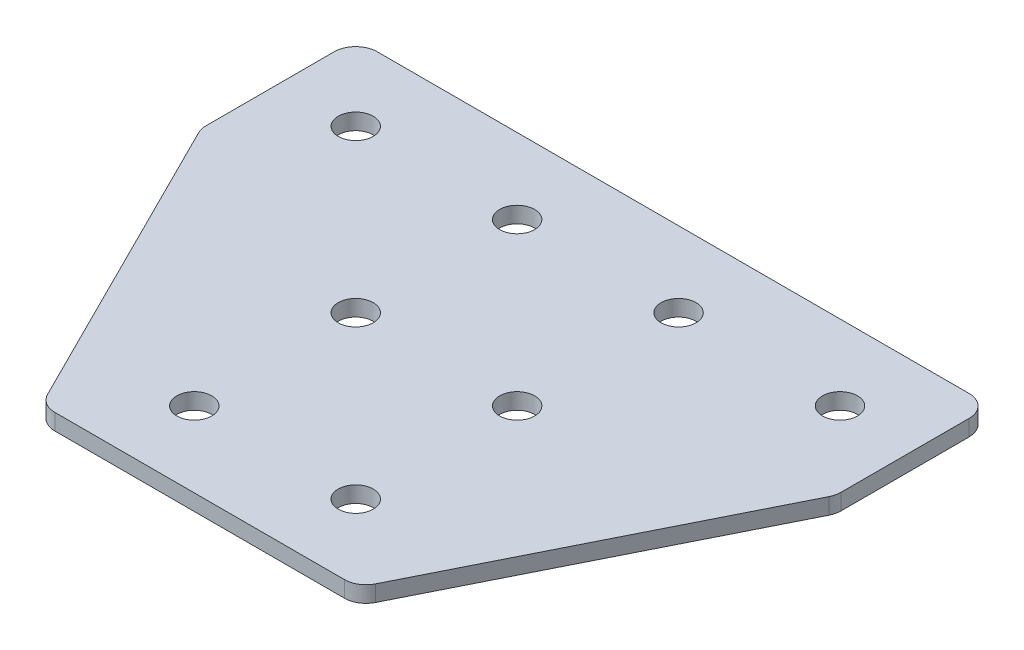
ISO-10303-21;
HEADER;
FILE_DESCRIPTION(('STEP AP214'),'2;1');
FILE_NAME('part.step','',(''),(''),'','','');
FILE_SCHEMA(('AUTOMOTIVE_DESIGN { 1 0 10303 214 1 1 1 1 }'));
ENDSEC;
DATA;
#1=APPLICATION_CONTEXT('core data for automotive mechanical design processes');
#2=APPLICATION_PROTOCOL_DEFINITION('international standard','automotive_design',2000,#1);
#3=PRODUCT_CONTEXT('',#1,'mechanical');
#4=PRODUCT('Part','Part','',(#3));
#5=PRODUCT_RELATED_PRODUCT_CATEGORY('part','',(#4));
#6=PRODUCT_DEFINITION_FORMATION('','',#4);
#7=PRODUCT_DEFINITION_CONTEXT('part definition',#1,'design');
#8=PRODUCT_DEFINITION('design','',#6,#7);
#9=PRODUCT_DEFINITION_SHAPE('','',#8);
#10=(LENGTH_UNIT() NAMED_UNIT(*) SI_UNIT(.MILLI.,.METRE.));
#11=(NAMED_UNIT(*) PLANE_ANGLE_UNIT() SI_UNIT($,.RADIAN.));
#12=(NAMED_UNIT(*) SI_UNIT($,.STERADIAN.) SOLID_ANGLE_UNIT());
#13=UNCERTAINTY_MEASURE_WITH_UNIT(LENGTH_MEASURE(1.E-05),#10,'distance_accuracy_value','');
#14=(GEOMETRIC_REPRESENTATION_CONTEXT(3) GLOBAL_UNCERTAINTY_ASSIGNED_CONTEXT((#13)) GLOBAL_UNIT_ASSIGNED_CONTEXT((#10,
#11,#12)) REPRESENTATION_CONTEXT('',''));
#15=CARTESIAN_POINT('',(0.,0.,0.));
#16=DIRECTION('',(0.,0.,1.));
#17=DIRECTION('',(1.,0.,0.));
#18=AXIS2_PLACEMENT_3D('',#15,#16,#17);
#19=CARTESIAN_POINT('',(-1.0203051665485,1.09143135976456,-15.8208269333067));
#20=DIRECTION('',(0.,-1.,0.));
#21=DIRECTION('',(0.,0.,-1.));
#22=AXIS2_PLACEMENT_3D('',#19,#20,#21);
#23=PLANE('',#22);
#24=DIRECTION('',(1.,0.,0.));
#25=VECTOR('',#24,1.);
#26=CARTESIAN_POINT('',(-15.5203051665486,1.09143135976456,21.1791730666933));
#27=LINE('',#26,#25);
#28=CARTESIAN_POINT('',(-14.4752201946739,1.09143135976456,21.1791730666932));
#29=VERTEX_POINT('',#28);
#30=CARTESIAN_POINT('',(12.4346098615769,1.09143135976456,21.1791730666932));
#31=VERTEX_POINT('',#30);
#32=EDGE_CURVE('E194',#29,#31,#27,.T.);
#33=ORIENTED_EDGE('',*,*,#32,.F.);
#34=CARTESIAN_POINT('',(-14.4752201946739,1.09143135976456,19.1791730666932));
#35=DIRECTION('',(0.,1.,0.));
#36=DIRECTION('',(0.,0.,-1.));
#37=AXIS2_PLACEMENT_3D('',#34,#35,#36);
#38=CIRCLE('',#37,2.);
#39=CARTESIAN_POINT('',(-16.2640745766737,1.09143135976456,20.0736002576931));
#40=VERTEX_POINT('',#39);
#41=EDGE_CURVE('E154',#40,#29,#38,.T.);
#42=ORIENTED_EDGE('',*,*,#41,.F.);
#43=DIRECTION('',(-0.447213595499954,0.,-0.894427190999918));
#44=VECTOR('',#43,1.);
#45=CARTESIAN_POINT('',(-15.7112881721737,1.09143135976456,21.1791730666932));
#46=LINE('',#45,#44);
#47=CARTESIAN_POINT('',(-30.3091595485482,1.09143135976456,-8.01656968605621));
#48=VERTEX_POINT('',#47);
#49=EDGE_CURVE('E141',#40,#48,#46,.T.);
#50=ORIENTED_EDGE('',*,*,#49,.T.);
#51=CARTESIAN_POINT('',(-28.5203051665484,1.09143135976456,-8.91099687705612));
#52=DIRECTION('',(0.,1.,0.));
#53=DIRECTION('',(0.,0.,-1.));
#54=AXIS2_PLACEMENT_3D('',#51,#52,#53);
#55=CIRCLE('',#54,2.);
#56=CARTESIAN_POINT('',(-30.5203051665484,1.09143135976456,-8.91099687705612));
#57=VERTEX_POINT('',#56);
#58=EDGE_CURVE('E152',#57,#48,#55,.T.);
#59=ORIENTED_EDGE('',*,*,#58,.F.);
#60=DIRECTION('',(0.,0.,-1.));
#61=VECTOR('',#60,1.);
#62=CARTESIAN_POINT('',(-30.5203051665484,1.09143135976456,-8.43886092205656));
#63=LINE('',#62,#61);
#64=CARTESIAN_POINT('',(-30.5203051665484,1.09143135976456,-20.8208269333068));
#65=VERTEX_POINT('',#64);
#66=EDGE_CURVE('E124',#57,#65,#63,.T.);
#67=ORIENTED_EDGE('',*,*,#66,.T.);
#68=CARTESIAN_POINT('',(-28.5203051665484,1.09143135976456,-20.8208269333068));
#69=DIRECTION('',(0.,1.,0.));
#70=DIRECTION('',(0.,0.,-1.));
#71=AXIS2_PLACEMENT_3D('',#68,#69,#70);
#72=CIRCLE('',#71,2.);
#73=CARTESIAN_POINT('',(-28.5203051665484,1.09143135976456,-22.8208269333068));
#74=VERTEX_POINT('',#73);
#75=EDGE_CURVE('E149',#74,#65,#72,.T.);
#76=ORIENTED_EDGE('',*,*,#75,.F.);
#77=DIRECTION('',(-1.,0.,0.));
#78=VECTOR('',#77,1.);
#79=CARTESIAN_POINT('',(28.4796948334514,1.09143135976456,-22.8208269333068));
#80=LINE('',#79,#78);
#81=CARTESIAN_POINT('',(26.4796948334514,1.09143135976456,-22.8208269333068));
#82=VERTEX_POINT('',#81);
#83=EDGE_CURVE('E191',#82,#74,#80,.T.);
#84=ORIENTED_EDGE('',*,*,#83,.F.);
#85=CARTESIAN_POINT('',(26.4796948334514,1.09143135976456,-20.8208269333068));
#86=DIRECTION('',(0.,-1.,0.));
#87=DIRECTION('',(0.,0.,-1.));
#88=AXIS2_PLACEMENT_3D('',#85,#86,#87);
#89=CIRCLE('',#88,2.);
#90=CARTESIAN_POINT('',(28.4796948334514,1.09143135976456,-20.8208269333068));
#91=VERTEX_POINT('',#90);
#92=EDGE_CURVE('E215',#82,#91,#89,.T.);
#93=ORIENTED_EDGE('',*,*,#92,.T.);
#94=DIRECTION('',(0.,0.,-1.));
#95=VECTOR('',#94,1.);
#96=CARTESIAN_POINT('',(28.4796948334514,1.09143135976456,-8.43886092205656));
#97=LINE('',#96,#95);
#98=CARTESIAN_POINT('',(28.4796948334514,1.09143135976456,-8.91099687705613));
#99=VERTEX_POINT('',#98);
#100=EDGE_CURVE('E188',#99,#91,#97,.T.);
#101=ORIENTED_EDGE('',*,*,#100,.F.);
#102=CARTESIAN_POINT('',(26.4796948334514,1.09143135976456,-8.91099687705613));
#103=DIRECTION('',(0.,-1.,0.));
#104=DIRECTION('',(0.,0.,-1.));
#105=AXIS2_PLACEMENT_3D('',#102,#103,#104);
#106=CIRCLE('',#105,2.);
#107=CARTESIAN_POINT('',(28.2685492154512,1.09143135976456,-8.01656968605621));
#108=VERTEX_POINT('',#107);
#109=EDGE_CURVE('E31',#99,#108,#106,.T.);
#110=ORIENTED_EDGE('',*,*,#109,.T.);
#111=DIRECTION('',(0.447213595499953,0.,-0.894427190999918));
#112=VECTOR('',#111,1.);
#113=CARTESIAN_POINT('',(13.6706778390767,1.09143135976456,21.1791730666932));
#114=LINE('',#113,#112);
#115=CARTESIAN_POINT('',(14.2234642435767,1.09143135976456,20.0736002576931));
#116=VERTEX_POINT('',#115);
#117=EDGE_CURVE('E196',#116,#108,#114,.T.);
#118=ORIENTED_EDGE('',*,*,#117,.F.);
#119=CARTESIAN_POINT('',(12.4346098615769,1.09143135976456,19.1791730666932));
#120=DIRECTION('',(0.,-1.,0.));
#121=DIRECTION('',(0.,0.,-1.));
#122=AXIS2_PLACEMENT_3D('',#119,#120,#121);
#123=CIRCLE('',#122,2.);
#124=EDGE_CURVE('E218',#116,#31,#123,.T.);
#125=ORIENTED_EDGE('',*,*,#124,.T.);
#126=EDGE_LOOP('',(#33,#42,#50,#59,#67,#76,#84,#93,#101,#110,#118,#125));
#127=FACE_BOUND('',#126,.T.);
#128=CARTESIAN_POINT('',(6.47969483345151,1.09143135976456,14.1791730666933));
#129=DIRECTION('',(0.,1.,0.));
#130=DIRECTION('',(0.,0.,1.));
#131=AXIS2_PLACEMENT_3D('',#128,#129,#130);
#132=CIRCLE('',#131,1.625);
#133=CARTESIAN_POINT('',(6.47969483345151,1.09143135976456,15.8041730666933));
#134=VERTEX_POINT('',#133);
#135=EDGE_CURVE('E164',#134,#134,#132,.T.);
#136=ORIENTED_EDGE('',*,*,#135,.T.);
#137=EDGE_LOOP('',(#136));
#138=FACE_BOUND('',#137,.T.);
#139=CARTESIAN_POINT('',(6.47969483345151,1.09143135976456,-0.820826933306712));
#140=DIRECTION('',(0.,1.,0.));
#141=DIRECTION('',(0.,0.,1.));
#142=AXIS2_PLACEMENT_3D('',#139,#140,#141);
#143=CIRCLE('',#142,1.625);
#144=CARTESIAN_POINT('',(6.47969483345151,1.09143135976456,0.804173066693288));
#145=VERTEX_POINT('',#144);
#146=EDGE_CURVE('E170',#145,#145,#143,.T.);
#147=ORIENTED_EDGE('',*,*,#146,.T.);
#148=EDGE_LOOP('',(#147));
#149=FACE_BOUND('',#148,.T.);
#150=CARTESIAN_POINT('',(21.4796948334515,1.09143135976456,-15.8208269333067));
#151=DIRECTION('',(0.,1.,0.));
#152=DIRECTION('',(0.,0.,1.));
#153=AXIS2_PLACEMENT_3D('',#150,#151,#152);
#154=CIRCLE('',#153,1.625);
#155=CARTESIAN_POINT('',(21.4796948334515,1.09143135976456,-14.1958269333067));
#156=VERTEX_POINT('',#155);
#157=EDGE_CURVE('E176',#156,#156,#154,.T.);
#158=ORIENTED_EDGE('',*,*,#157,.T.);
#159=EDGE_LOOP('',(#158));
#160=FACE_BOUND('',#159,.T.);
#161=CARTESIAN_POINT('',(6.47969483345151,1.09143135976456,-15.8208269333067));
#162=DIRECTION('',(0.,1.,0.));
#163=DIRECTION('',(0.,0.,1.));
#164=AXIS2_PLACEMENT_3D('',#161,#162,#163);
#165=CIRCLE('',#164,1.625);
#166=CARTESIAN_POINT('',(6.47969483345151,1.09143135976456,-14.1958269333067));
#167=VERTEX_POINT('',#166);
#168=EDGE_CURVE('E182',#167,#167,#165,.T.);
#169=ORIENTED_EDGE('',*,*,#168,.T.);
#170=EDGE_LOOP('',(#169));
#171=FACE_BOUND('',#170,.T.);
#172=CARTESIAN_POINT('',(-8.5203051665485,1.09143135976456,14.1791730666933));
#173=DIRECTION('',(0.,-1.,0.));
#174=DIRECTION('',(0.,0.,1.));
#175=AXIS2_PLACEMENT_3D('',#172,#173,#174);
#176=CIRCLE('',#175,1.625);
#177=CARTESIAN_POINT('',(-8.5203051665485,1.09143135976456,15.8041730666933));
#178=VERTEX_POINT('',#177);
#179=EDGE_CURVE('E270',#178,#178,#176,.T.);
#180=ORIENTED_EDGE('',*,*,#179,.F.);
#181=EDGE_LOOP('',(#180));
#182=FACE_BOUND('',#181,.T.);
#183=CARTESIAN_POINT('',(-8.5203051665485,1.09143135976456,-0.82082693330671));
#184=DIRECTION('',(0.,-1.,0.));
#185=DIRECTION('',(0.,0.,1.));
#186=AXIS2_PLACEMENT_3D('',#183,#184,#185);
#187=CIRCLE('',#186,1.625);
#188=CARTESIAN_POINT('',(-8.5203051665485,1.09143135976456,0.80417306669329));
#189=VERTEX_POINT('',#188);
#190=EDGE_CURVE('E264',#189,#189,#187,.T.);
#191=ORIENTED_EDGE('',*,*,#190,.F.);
#192=EDGE_LOOP('',(#191));
#193=FACE_BOUND('',#192,.T.);
#194=CARTESIAN_POINT('',(-23.5203051665485,1.09143135976456,-15.8208269333067));
#195=DIRECTION('',(0.,-1.,0.));
#196=DIRECTION('',(0.,0.,1.));
#197=AXIS2_PLACEMENT_3D('',#194,#195,#196);
#198=CIRCLE('',#197,1.625);
#199=CARTESIAN_POINT('',(-23.5203051665485,1.09143135976456,-14.1958269333067));
#200=VERTEX_POINT('',#199);
#201=EDGE_CURVE('E259',#200,#200,#198,.T.);
#202=ORIENTED_EDGE('',*,*,#201,.F.);
#203=EDGE_LOOP('',(#202));
#204=FACE_BOUND('',#203,.T.);
#205=CARTESIAN_POINT('',(-8.52030516654851,1.09143135976456,-15.8208269333067));
#206=DIRECTION('',(0.,-1.,0.));
#207=DIRECTION('',(0.,0.,1.));
#208=AXIS2_PLACEMENT_3D('',#205,#206,#207);
#209=CIRCLE('',#208,1.625);
#210=CARTESIAN_POINT('',(-8.52030516654851,1.09143135976456,-14.1958269333067));
#211=VERTEX_POINT('',#210);
#212=EDGE_CURVE('E134',#211,#211,#209,.T.);
#213=ORIENTED_EDGE('',*,*,#212,.F.);
#214=EDGE_LOOP('',(#213));
#215=FACE_BOUND('',#214,.T.);
#216=ADVANCED_FACE('F16',(#127,#138,#149,#160,#171,#182,#193,#204,#215),#23,.T.);
#217=CARTESIAN_POINT('',(28.4796948334514,1.09143135976456,-8.43886092205656));
#218=DIRECTION('',(1.,0.,0.));
#219=DIRECTION('',(0.,0.,-1.));
#220=AXIS2_PLACEMENT_3D('',#217,#218,#219);
#221=PLANE('',#220);
#222=DIRECTION('',(0.,0.,-1.));
#223=VECTOR('',#222,1.);
#224=CARTESIAN_POINT('',(28.4796948334514,2.59143135976456,-8.43886092205656));
#225=LINE('',#224,#223);
#226=CARTESIAN_POINT('',(28.4796948334514,2.59143135976456,-8.91099687705613));
#227=VERTEX_POINT('',#226);
#228=CARTESIAN_POINT('',(28.4796948334514,2.59143135976456,-20.8208269333068));
#229=VERTEX_POINT('',#228);
#230=EDGE_CURVE('E185',#227,#229,#225,.T.);
#231=ORIENTED_EDGE('',*,*,#230,.F.);
#232=DIRECTION('',(0.,1.,0.));
#233=VECTOR('',#232,1.);
#234=CARTESIAN_POINT('',(28.4796948334514,1.09143135976456,-8.91099687705613));
#235=LINE('',#234,#233);
#236=EDGE_CURVE('E24',#227,#99,#235,.F.);
#237=ORIENTED_EDGE('',*,*,#236,.T.);
#238=ORIENTED_EDGE('',*,*,#100,.T.);
#239=DIRECTION('',(0.,1.,0.));
#240=VECTOR('',#239,1.);
#241=CARTESIAN_POINT('',(28.4796948334514,1.09143135976456,-20.8208269333068));
#242=LINE('',#241,#240);
#243=EDGE_CURVE('E225',#91,#229,#242,.T.);
#244=ORIENTED_EDGE('',*,*,#243,.T.);
#245=EDGE_LOOP('',(#231,#237,#238,#244));
#246=FACE_BOUND('',#245,.T.);
#247=ADVANCED_FACE('F230',(#246),#221,.T.);
#248=CARTESIAN_POINT('',(13.6706778390767,1.09143135976456,21.1791730666932));
#249=DIRECTION('',(0.894427190999918,0.,0.447213595499954));
#250=DIRECTION('',(0.447213595499954,0.,-0.894427190999918));
#251=AXIS2_PLACEMENT_3D('',#248,#249,#250);
#252=PLANE('',#251);
#253=DIRECTION('',(0.447213595499953,0.,-0.894427190999918));
#254=VECTOR('',#253,1.);
#255=CARTESIAN_POINT('',(13.6706778390767,2.59143135976456,21.1791730666932));
#256=LINE('',#255,#254);
#257=CARTESIAN_POINT('',(14.2234642435767,2.59143135976456,20.0736002576931));
#258=VERTEX_POINT('',#257);
#259=CARTESIAN_POINT('',(28.2685492154512,2.59143135976456,-8.01656968605621));
#260=VERTEX_POINT('',#259);
#261=EDGE_CURVE('E192',#258,#260,#256,.T.);
#262=ORIENTED_EDGE('',*,*,#261,.F.);
#263=DIRECTION('',(0.,1.,0.));
#264=VECTOR('',#263,1.);
#265=CARTESIAN_POINT('',(14.2234642435767,1.09143135976456,20.0736002576931));
#266=LINE('',#265,#264);
#267=EDGE_CURVE('E38',#258,#116,#266,.F.);
#268=ORIENTED_EDGE('',*,*,#267,.T.);
#269=ORIENTED_EDGE('',*,*,#117,.T.);
#270=DIRECTION('',(0.,1.,0.));
#271=VECTOR('',#270,1.);
#272=CARTESIAN_POINT('',(28.2685492154512,1.09143135976456,-8.01656968605622));
#273=LINE('',#272,#271);
#274=EDGE_CURVE('E221',#108,#260,#273,.T.);
#275=ORIENTED_EDGE('',*,*,#274,.T.);
#276=EDGE_LOOP('',(#262,#268,#269,#275));
#277=FACE_BOUND('',#276,.T.);
#278=ADVANCED_FACE('F238',(#277),#252,.T.);
#279=CARTESIAN_POINT('',(-15.5203051665486,1.09143135976456,21.1791730666933));
#280=DIRECTION('',(0.,0.,1.));
#281=DIRECTION('',(1.,0.,0.));
#282=AXIS2_PLACEMENT_3D('',#279,#280,#281);
#283=PLANE('',#282);
#284=DIRECTION('',(1.,0.,0.));
#285=VECTOR('',#284,1.);
#286=CARTESIAN_POINT('',(-15.5203051665486,2.59143135976456,21.1791730666933));
#287=LINE('',#286,#285);
#288=CARTESIAN_POINT('',(-14.4752201946739,2.59143135976456,21.1791730666932));
#289=VERTEX_POINT('',#288);
#290=CARTESIAN_POINT('',(12.4346098615769,2.59143135976456,21.1791730666932));
#291=VERTEX_POINT('',#290);
#292=EDGE_CURVE('E203',#289,#291,#287,.T.);
#293=ORIENTED_EDGE('',*,*,#292,.F.);
#294=DIRECTION('',(0.,1.,0.));
#295=VECTOR('',#294,1.);
#296=CARTESIAN_POINT('',(-14.4752201946739,1.09143135976456,21.1791730666932));
#297=LINE('',#296,#295);
#298=EDGE_CURVE('E146',#29,#289,#297,.T.);
#299=ORIENTED_EDGE('',*,*,#298,.F.);
#300=ORIENTED_EDGE('',*,*,#32,.T.);
#301=DIRECTION('',(0.,1.,0.));
#302=VECTOR('',#301,1.);
#303=CARTESIAN_POINT('',(12.4346098615769,1.09143135976456,21.1791730666932));
#304=LINE('',#303,#302);
#305=EDGE_CURVE('E212',#31,#291,#304,.T.);
#306=ORIENTED_EDGE('',*,*,#305,.T.);
#307=EDGE_LOOP('',(#293,#299,#300,#306));
#308=FACE_BOUND('',#307,.T.);
#309=ADVANCED_FACE('F246',(#308),#283,.T.);
#310=CARTESIAN_POINT('',(28.4796948334514,1.09143135976456,-22.8208269333068));
#311=DIRECTION('',(0.,0.,-1.));
#312=DIRECTION('',(-1.,0.,0.));
#313=AXIS2_PLACEMENT_3D('',#310,#311,#312);
#314=PLANE('',#313);
#315=ORIENTED_EDGE('',*,*,#83,.T.);
#316=DIRECTION('',(0.,1.,0.));
#317=VECTOR('',#316,1.);
#318=CARTESIAN_POINT('',(-28.5203051665484,1.09143135976456,-22.8208269333068));
#319=LINE('',#318,#317);
#320=CARTESIAN_POINT('',(-28.5203051665484,2.59143135976456,-22.8208269333068));
#321=VERTEX_POINT('',#320);
#322=EDGE_CURVE('E126',#321,#74,#319,.F.);
#323=ORIENTED_EDGE('',*,*,#322,.F.);
#324=DIRECTION('',(-1.,0.,0.));
#325=VECTOR('',#324,1.);
#326=CARTESIAN_POINT('',(28.4796948334514,2.59143135976456,-22.8208269333068));
#327=LINE('',#326,#325);
#328=CARTESIAN_POINT('',(26.4796948334514,2.59143135976456,-22.8208269333068));
#329=VERTEX_POINT('',#328);
#330=EDGE_CURVE('E201',#329,#321,#327,.T.);
#331=ORIENTED_EDGE('',*,*,#330,.F.);
#332=DIRECTION('',(0.,1.,0.));
#333=VECTOR('',#332,1.);
#334=CARTESIAN_POINT('',(26.4796948334514,1.09143135976456,-22.8208269333068));
#335=LINE('',#334,#333);
#336=EDGE_CURVE('E10',#329,#82,#335,.F.);
#337=ORIENTED_EDGE('',*,*,#336,.T.);
#338=EDGE_LOOP('',(#315,#323,#331,#337));
#339=FACE_BOUND('',#338,.T.);
#340=ADVANCED_FACE('F300',(#339),#314,.T.);
#341=CARTESIAN_POINT('',(-1.0203051665485,2.59143135976456,-15.8208269333067));
#342=DIRECTION('',(0.,-1.,0.));
#343=DIRECTION('',(0.,0.,-1.));
#344=AXIS2_PLACEMENT_3D('',#341,#342,#343);
#345=PLANE('',#344);
#346=CARTESIAN_POINT('',(6.47969483345151,2.59143135976456,14.1791730666933));
#347=DIRECTION('',(0.,1.,0.));
#348=DIRECTION('',(0.,0.,1.));
#349=AXIS2_PLACEMENT_3D('',#346,#347,#348);
#350=CIRCLE('',#349,1.625);
#351=CARTESIAN_POINT('',(6.47969483345151,2.59143135976456,15.8041730666933));
#352=VERTEX_POINT('',#351);
#353=EDGE_CURVE('E163',#352,#352,#350,.T.);
#354=ORIENTED_EDGE('',*,*,#353,.F.);
#355=EDGE_LOOP('',(#354));
#356=FACE_BOUND('',#355,.T.);
#357=CARTESIAN_POINT('',(6.47969483345151,2.59143135976456,-0.820826933306712));
#358=DIRECTION('',(0.,1.,0.));
#359=DIRECTION('',(0.,0.,1.));
#360=AXIS2_PLACEMENT_3D('',#357,#358,#359);
#361=CIRCLE('',#360,1.625);
#362=CARTESIAN_POINT('',(6.47969483345151,2.59143135976456,0.804173066693288));
#363=VERTEX_POINT('',#362);
#364=EDGE_CURVE('E167',#363,#363,#361,.T.);
#365=ORIENTED_EDGE('',*,*,#364,.F.);
#366=EDGE_LOOP('',(#365));
#367=FACE_BOUND('',#366,.T.);
#368=CARTESIAN_POINT('',(21.4796948334515,2.59143135976456,-15.8208269333067));
#369=DIRECTION('',(0.,1.,0.));
#370=DIRECTION('',(0.,0.,1.));
#371=AXIS2_PLACEMENT_3D('',#368,#369,#370);
#372=CIRCLE('',#371,1.625);
#373=CARTESIAN_POINT('',(21.4796948334515,2.59143135976456,-14.1958269333067));
#374=VERTEX_POINT('',#373);
#375=EDGE_CURVE('E173',#374,#374,#372,.T.);
#376=ORIENTED_EDGE('',*,*,#375,.F.);
#377=EDGE_LOOP('',(#376));
#378=FACE_BOUND('',#377,.T.);
#379=CARTESIAN_POINT('',(6.47969483345151,2.59143135976456,-15.8208269333067));
#380=DIRECTION('',(0.,1.,0.));
#381=DIRECTION('',(0.,0.,1.));
#382=AXIS2_PLACEMENT_3D('',#379,#380,#381);
#383=CIRCLE('',#382,1.625);
#384=CARTESIAN_POINT('',(6.47969483345151,2.59143135976456,-14.1958269333067));
#385=VERTEX_POINT('',#384);
#386=EDGE_CURVE('E179',#385,#385,#383,.T.);
#387=ORIENTED_EDGE('',*,*,#386,.F.);
#388=EDGE_LOOP('',(#387));
#389=FACE_BOUND('',#388,.T.);
#390=ORIENTED_EDGE('',*,*,#330,.T.);
#391=CARTESIAN_POINT('',(-28.5203051665484,2.59143135976456,-20.8208269333068));
#392=DIRECTION('',(0.,1.,0.));
#393=DIRECTION('',(0.,0.,-1.));
#394=AXIS2_PLACEMENT_3D('',#391,#392,#393);
#395=CIRCLE('',#394,2.);
#396=CARTESIAN_POINT('',(-30.5203051665484,2.59143135976456,-20.8208269333068));
#397=VERTEX_POINT('',#396);
#398=EDGE_CURVE('E117',#397,#321,#395,.F.);
#399=ORIENTED_EDGE('',*,*,#398,.F.);
#400=DIRECTION('',(0.,0.,-1.));
#401=VECTOR('',#400,1.);
#402=CARTESIAN_POINT('',(-30.5203051665484,2.59143135976456,-8.43886092205656));
#403=LINE('',#402,#401);
#404=CARTESIAN_POINT('',(-30.5203051665484,2.59143135976456,-8.91099687705612));
#405=VERTEX_POINT('',#404);
#406=EDGE_CURVE('E122',#405,#397,#403,.T.);
#407=ORIENTED_EDGE('',*,*,#406,.F.);
#408=CARTESIAN_POINT('',(-28.5203051665484,2.59143135976456,-8.91099687705612));
#409=DIRECTION('',(0.,1.,0.));
#410=DIRECTION('',(0.,0.,-1.));
#411=AXIS2_PLACEMENT_3D('',#408,#409,#410);
#412=CIRCLE('',#411,2.);
#413=CARTESIAN_POINT('',(-30.3091595485482,2.59143135976456,-8.01656968605621));
#414=VERTEX_POINT('',#413);
#415=EDGE_CURVE('E105',#414,#405,#412,.F.);
#416=ORIENTED_EDGE('',*,*,#415,.F.);
#417=DIRECTION('',(-0.447213595499954,0.,-0.894427190999918));
#418=VECTOR('',#417,1.);
#419=CARTESIAN_POINT('',(-15.7112881721737,2.59143135976456,21.1791730666932));
#420=LINE('',#419,#418);
#421=CARTESIAN_POINT('',(-16.2640745766737,2.59143135976456,20.0736002576931));
#422=VERTEX_POINT('',#421);
#423=EDGE_CURVE('E133',#422,#414,#420,.T.);
#424=ORIENTED_EDGE('',*,*,#423,.F.);
#425=CARTESIAN_POINT('',(-14.4752201946739,2.59143135976456,19.1791730666932));
#426=DIRECTION('',(0.,1.,0.));
#427=DIRECTION('',(0.,0.,-1.));
#428=AXIS2_PLACEMENT_3D('',#425,#426,#427);
#429=CIRCLE('',#428,2.);
#430=EDGE_CURVE('E116',#289,#422,#429,.F.);
#431=ORIENTED_EDGE('',*,*,#430,.F.);
#432=ORIENTED_EDGE('',*,*,#292,.T.);
#433=CARTESIAN_POINT('',(12.4346098615769,2.59143135976456,19.1791730666932));
#434=DIRECTION('',(0.,-1.,0.));
#435=DIRECTION('',(0.,0.,-1.));
#436=AXIS2_PLACEMENT_3D('',#433,#434,#435);
#437=CIRCLE('',#436,2.);
#438=EDGE_CURVE('E210',#291,#258,#437,.F.);
#439=ORIENTED_EDGE('',*,*,#438,.T.);
#440=ORIENTED_EDGE('',*,*,#261,.T.);
#441=CARTESIAN_POINT('',(26.4796948334514,2.59143135976456,-8.91099687705613));
#442=DIRECTION('',(0.,-1.,0.));
#443=DIRECTION('',(0.,0.,-1.));
#444=AXIS2_PLACEMENT_3D('',#441,#442,#443);
#445=CIRCLE('',#444,2.);
#446=EDGE_CURVE('E208',#260,#227,#445,.F.);
#447=ORIENTED_EDGE('',*,*,#446,.T.);
#448=ORIENTED_EDGE('',*,*,#230,.T.);
#449=CARTESIAN_POINT('',(26.4796948334514,2.59143135976456,-20.8208269333068));
#450=DIRECTION('',(0.,-1.,0.));
#451=DIRECTION('',(0.,0.,-1.));
#452=AXIS2_PLACEMENT_3D('',#449,#450,#451);
#453=CIRCLE('',#452,2.);
#454=EDGE_CURVE('E198',#229,#329,#453,.F.);
#455=ORIENTED_EDGE('',*,*,#454,.T.);
#456=EDGE_LOOP('',(#390,#399,#407,#416,#424,#431,#432,#439,#440,#447,#448,#455));
#457=FACE_BOUND('',#456,.T.);
#458=CARTESIAN_POINT('',(-8.5203051665485,2.59143135976456,14.1791730666933));
#459=DIRECTION('',(0.,-1.,0.));
#460=DIRECTION('',(0.,0.,1.));
#461=AXIS2_PLACEMENT_3D('',#458,#459,#460);
#462=CIRCLE('',#461,1.625);
#463=CARTESIAN_POINT('',(-8.5203051665485,2.59143135976456,15.8041730666933));
#464=VERTEX_POINT('',#463);
#465=EDGE_CURVE('E273',#464,#464,#462,.T.);
#466=ORIENTED_EDGE('',*,*,#465,.T.);
#467=EDGE_LOOP('',(#466));
#468=FACE_BOUND('',#467,.T.);
#469=CARTESIAN_POINT('',(-8.5203051665485,2.59143135976456,-0.82082693330671));
#470=DIRECTION('',(0.,-1.,0.));
#471=DIRECTION('',(0.,0.,1.));
#472=AXIS2_PLACEMENT_3D('',#469,#470,#471);
#473=CIRCLE('',#472,1.625);
#474=CARTESIAN_POINT('',(-8.5203051665485,2.59143135976456,0.80417306669329));
#475=VERTEX_POINT('',#474);
#476=EDGE_CURVE('E267',#475,#475,#473,.T.);
#477=ORIENTED_EDGE('',*,*,#476,.T.);
#478=EDGE_LOOP('',(#477));
#479=FACE_BOUND('',#478,.T.);
#480=CARTESIAN_POINT('',(-23.5203051665485,2.59143135976456,-15.8208269333067));
#481=DIRECTION('',(0.,-1.,0.));
#482=DIRECTION('',(0.,0.,1.));
#483=AXIS2_PLACEMENT_3D('',#480,#481,#482);
#484=CIRCLE('',#483,1.625);
#485=CARTESIAN_POINT('',(-23.5203051665485,2.59143135976456,-14.1958269333067));
#486=VERTEX_POINT('',#485);
#487=EDGE_CURVE('E261',#486,#486,#484,.T.);
#488=ORIENTED_EDGE('',*,*,#487,.T.);
#489=EDGE_LOOP('',(#488));
#490=FACE_BOUND('',#489,.T.);
#491=CARTESIAN_POINT('',(-8.52030516654851,2.59143135976456,-15.8208269333067));
#492=DIRECTION('',(0.,-1.,0.));
#493=DIRECTION('',(0.,0.,1.));
#494=AXIS2_PLACEMENT_3D('',#491,#492,#493);
#495=CIRCLE('',#494,1.625);
#496=CARTESIAN_POINT('',(-8.52030516654851,2.59143135976456,-14.1958269333067));
#497=VERTEX_POINT('',#496);
#498=EDGE_CURVE('E138',#497,#497,#495,.T.);
#499=ORIENTED_EDGE('',*,*,#498,.T.);
#500=EDGE_LOOP('',(#499));
#501=FACE_BOUND('',#500,.T.);
#502=ADVANCED_FACE('F129',(#356,#367,#378,#389,#457,#468,#479,#490,#501),#345,.F.);
#503=CARTESIAN_POINT('',(12.4346098615769,1.09143135976456,19.1791730666932));
#504=DIRECTION('',(0.,1.,0.));
#505=DIRECTION('',(0.,0.,1.));
#506=AXIS2_PLACEMENT_3D('',#503,#504,#505);
#507=CYLINDRICAL_SURFACE('',#506,2.);
#508=ORIENTED_EDGE('',*,*,#124,.F.);
#509=ORIENTED_EDGE('',*,*,#267,.F.);
#510=ORIENTED_EDGE('',*,*,#438,.F.);
#511=ORIENTED_EDGE('',*,*,#305,.F.);
#512=EDGE_LOOP('',(#508,#509,#510,#511));
#513=FACE_BOUND('',#512,.T.);
#514=ADVANCED_FACE('F244',(#513),#507,.T.);
#515=CARTESIAN_POINT('',(26.4796948334514,1.09143135976456,-8.91099687705613));
#516=DIRECTION('',(0.,1.,0.));
#517=DIRECTION('',(0.,0.,1.));
#518=AXIS2_PLACEMENT_3D('',#515,#516,#517);
#519=CYLINDRICAL_SURFACE('',#518,2.);
#520=ORIENTED_EDGE('',*,*,#109,.F.);
#521=ORIENTED_EDGE('',*,*,#236,.F.);
#522=ORIENTED_EDGE('',*,*,#446,.F.);
#523=ORIENTED_EDGE('',*,*,#274,.F.);
#524=EDGE_LOOP('',(#520,#521,#522,#523));
#525=FACE_BOUND('',#524,.T.);
#526=ADVANCED_FACE('F237',(#525),#519,.T.);
#527=CARTESIAN_POINT('',(26.4796948334514,1.09143135976456,-20.8208269333068));
#528=DIRECTION('',(0.,1.,0.));
#529=DIRECTION('',(0.,0.,1.));
#530=AXIS2_PLACEMENT_3D('',#527,#528,#529);
#531=CYLINDRICAL_SURFACE('',#530,2.);
#532=ORIENTED_EDGE('',*,*,#92,.F.);
#533=ORIENTED_EDGE('',*,*,#336,.F.);
#534=ORIENTED_EDGE('',*,*,#454,.F.);
#535=ORIENTED_EDGE('',*,*,#243,.F.);
#536=EDGE_LOOP('',(#532,#533,#534,#535));
#537=FACE_BOUND('',#536,.T.);
#538=ADVANCED_FACE('F18',(#537),#531,.T.);
#539=CARTESIAN_POINT('',(6.47969483345151,1.09143135976456,-15.8208269333067));
#540=DIRECTION('',(0.,1.,0.));
#541=DIRECTION('',(0.,0.,1.));
#542=AXIS2_PLACEMENT_3D('',#539,#540,#541);
#543=CYLINDRICAL_SURFACE('',#542,1.625);
#544=ORIENTED_EDGE('',*,*,#168,.F.);
#545=EDGE_LOOP('',(#544));
#546=FACE_BOUND('',#545,.T.);
#547=ORIENTED_EDGE('',*,*,#386,.T.);
#548=EDGE_LOOP('',(#547));
#549=FACE_BOUND('',#548,.T.);
#550=ADVANCED_FACE('F318',(#546,#549),#543,.F.);
#551=CARTESIAN_POINT('',(21.4796948334515,1.09143135976456,-15.8208269333067));
#552=DIRECTION('',(0.,1.,0.));
#553=DIRECTION('',(0.,0.,1.));
#554=AXIS2_PLACEMENT_3D('',#551,#552,#553);
#555=CYLINDRICAL_SURFACE('',#554,1.625);
#556=ORIENTED_EDGE('',*,*,#157,.F.);
#557=EDGE_LOOP('',(#556));
#558=FACE_BOUND('',#557,.T.);
#559=ORIENTED_EDGE('',*,*,#375,.T.);
#560=EDGE_LOOP('',(#559));
#561=FACE_BOUND('',#560,.T.);
#562=ADVANCED_FACE('F323',(#558,#561),#555,.F.);
#563=CARTESIAN_POINT('',(6.47969483345151,1.09143135976456,-0.820826933306712));
#564=DIRECTION('',(0.,1.,0.));
#565=DIRECTION('',(0.,0.,1.));
#566=AXIS2_PLACEMENT_3D('',#563,#564,#565);
#567=CYLINDRICAL_SURFACE('',#566,1.625);
#568=ORIENTED_EDGE('',*,*,#146,.F.);
#569=EDGE_LOOP('',(#568));
#570=FACE_BOUND('',#569,.T.);
#571=ORIENTED_EDGE('',*,*,#364,.T.);
#572=EDGE_LOOP('',(#571));
#573=FACE_BOUND('',#572,.T.);
#574=ADVANCED_FACE('F341',(#570,#573),#567,.F.);
#575=CARTESIAN_POINT('',(6.47969483345151,1.09143135976456,14.1791730666933));
#576=DIRECTION('',(0.,1.,0.));
#577=DIRECTION('',(0.,0.,1.));
#578=AXIS2_PLACEMENT_3D('',#575,#576,#577);
#579=CYLINDRICAL_SURFACE('',#578,1.625);
#580=ORIENTED_EDGE('',*,*,#135,.F.);
#581=EDGE_LOOP('',(#580));
#582=FACE_BOUND('',#581,.T.);
#583=ORIENTED_EDGE('',*,*,#353,.T.);
#584=EDGE_LOOP('',(#583));
#585=FACE_BOUND('',#584,.T.);
#586=ADVANCED_FACE('F338',(#582,#585),#579,.F.);
#587=CARTESIAN_POINT('',(-30.5203051665484,1.09143135976456,-8.43886092205656));
#588=DIRECTION('',(-1.,0.,0.));
#589=DIRECTION('',(0.,0.,-1.));
#590=AXIS2_PLACEMENT_3D('',#587,#588,#589);
#591=PLANE('',#590);
#592=ORIENTED_EDGE('',*,*,#406,.T.);
#593=DIRECTION('',(0.,1.,0.));
#594=VECTOR('',#593,1.);
#595=CARTESIAN_POINT('',(-30.5203051665484,1.09143135976456,-20.8208269333068));
#596=LINE('',#595,#594);
#597=EDGE_CURVE('E127',#65,#397,#596,.T.);
#598=ORIENTED_EDGE('',*,*,#597,.F.);
#599=ORIENTED_EDGE('',*,*,#66,.F.);
#600=DIRECTION('',(0.,1.,0.));
#601=VECTOR('',#600,1.);
#602=CARTESIAN_POINT('',(-30.5203051665484,1.09143135976456,-8.91099687705612));
#603=LINE('',#602,#601);
#604=EDGE_CURVE('E109',#405,#57,#603,.F.);
#605=ORIENTED_EDGE('',*,*,#604,.F.);
#606=EDGE_LOOP('',(#592,#598,#599,#605));
#607=FACE_BOUND('',#606,.T.);
#608=ADVANCED_FACE('F121',(#607),#591,.T.);
#609=CARTESIAN_POINT('',(-15.7112881721737,1.09143135976456,21.1791730666932));
#610=DIRECTION('',(-0.894427190999918,0.,0.447213595499954));
#611=DIRECTION('',(-0.447213595499954,0.,-0.894427190999918));
#612=AXIS2_PLACEMENT_3D('',#609,#610,#611);
#613=PLANE('',#612);
#614=ORIENTED_EDGE('',*,*,#423,.T.);
#615=DIRECTION('',(0.,1.,0.));
#616=VECTOR('',#615,1.);
#617=CARTESIAN_POINT('',(-30.3091595485482,1.09143135976456,-8.01656968605621));
#618=LINE('',#617,#616);
#619=EDGE_CURVE('E111',#48,#414,#618,.T.);
#620=ORIENTED_EDGE('',*,*,#619,.F.);
#621=ORIENTED_EDGE('',*,*,#49,.F.);
#622=DIRECTION('',(0.,1.,0.));
#623=VECTOR('',#622,1.);
#624=CARTESIAN_POINT('',(-16.2640745766737,1.09143135976456,20.0736002576931));
#625=LINE('',#624,#623);
#626=EDGE_CURVE('E158',#422,#40,#625,.F.);
#627=ORIENTED_EDGE('',*,*,#626,.F.);
#628=EDGE_LOOP('',(#614,#620,#621,#627));
#629=FACE_BOUND('',#628,.T.);
#630=ADVANCED_FACE('F255',(#629),#613,.T.);
#631=CARTESIAN_POINT('',(-14.4752201946739,1.09143135976456,19.1791730666932));
#632=DIRECTION('',(0.,1.,0.));
#633=DIRECTION('',(0.,0.,1.));
#634=AXIS2_PLACEMENT_3D('',#631,#632,#633);
#635=CYLINDRICAL_SURFACE('',#634,2.);
#636=ORIENTED_EDGE('',*,*,#41,.T.);
#637=ORIENTED_EDGE('',*,*,#298,.T.);
#638=ORIENTED_EDGE('',*,*,#430,.T.);
#639=ORIENTED_EDGE('',*,*,#626,.T.);
#640=EDGE_LOOP('',(#636,#637,#638,#639));
#641=FACE_BOUND('',#640,.T.);
#642=ADVANCED_FACE('F252',(#641),#635,.T.);
#643=CARTESIAN_POINT('',(-28.5203051665484,1.09143135976456,-8.91099687705612));
#644=DIRECTION('',(0.,1.,0.));
#645=DIRECTION('',(0.,0.,1.));
#646=AXIS2_PLACEMENT_3D('',#643,#644,#645);
#647=CYLINDRICAL_SURFACE('',#646,2.);
#648=ORIENTED_EDGE('',*,*,#58,.T.);
#649=ORIENTED_EDGE('',*,*,#619,.T.);
#650=ORIENTED_EDGE('',*,*,#415,.T.);
#651=ORIENTED_EDGE('',*,*,#604,.T.);
#652=EDGE_LOOP('',(#648,#649,#650,#651));
#653=FACE_BOUND('',#652,.T.);
#654=ADVANCED_FACE('F108',(#653),#647,.T.);
#655=CARTESIAN_POINT('',(-28.5203051665484,1.09143135976456,-20.8208269333068));
#656=DIRECTION('',(0.,1.,0.));
#657=DIRECTION('',(0.,0.,1.));
#658=AXIS2_PLACEMENT_3D('',#655,#656,#657);
#659=CYLINDRICAL_SURFACE('',#658,2.);
#660=ORIENTED_EDGE('',*,*,#75,.T.);
#661=ORIENTED_EDGE('',*,*,#597,.T.);
#662=ORIENTED_EDGE('',*,*,#398,.T.);
#663=ORIENTED_EDGE('',*,*,#322,.T.);
#664=EDGE_LOOP('',(#660,#661,#662,#663));
#665=FACE_BOUND('',#664,.T.);
#666=ADVANCED_FACE('F295',(#665),#659,.T.);
#667=CARTESIAN_POINT('',(-8.52030516654851,1.09143135976456,-15.8208269333067));
#668=DIRECTION('',(0.,1.,0.));
#669=DIRECTION('',(0.,0.,1.));
#670=AXIS2_PLACEMENT_3D('',#667,#668,#669);
#671=CYLINDRICAL_SURFACE('',#670,1.625);
#672=ORIENTED_EDGE('',*,*,#212,.T.);
#673=EDGE_LOOP('',(#672));
#674=FACE_BOUND('',#673,.T.);
#675=ORIENTED_EDGE('',*,*,#498,.F.);
#676=EDGE_LOOP('',(#675));
#677=FACE_BOUND('',#676,.T.);
#678=ADVANCED_FACE('F291',(#674,#677),#671,.F.);
#679=CARTESIAN_POINT('',(-23.5203051665485,1.09143135976456,-15.8208269333067));
#680=DIRECTION('',(0.,1.,0.));
#681=DIRECTION('',(0.,0.,1.));
#682=AXIS2_PLACEMENT_3D('',#679,#680,#681);
#683=CYLINDRICAL_SURFACE('',#682,1.625);
#684=ORIENTED_EDGE('',*,*,#201,.T.);
#685=EDGE_LOOP('',(#684));
#686=FACE_BOUND('',#685,.T.);
#687=ORIENTED_EDGE('',*,*,#487,.F.);
#688=EDGE_LOOP('',(#687));
#689=FACE_BOUND('',#688,.T.);
#690=ADVANCED_FACE('F294',(#686,#689),#683,.F.);
#691=CARTESIAN_POINT('',(-8.5203051665485,1.09143135976456,-0.82082693330671));
#692=DIRECTION('',(0.,1.,0.));
#693=DIRECTION('',(0.,0.,1.));
#694=AXIS2_PLACEMENT_3D('',#691,#692,#693);
#695=CYLINDRICAL_SURFACE('',#694,1.625);
#696=ORIENTED_EDGE('',*,*,#190,.T.);
#697=EDGE_LOOP('',(#696));
#698=FACE_BOUND('',#697,.T.);
#699=ORIENTED_EDGE('',*,*,#476,.F.);
#700=EDGE_LOOP('',(#699));
#701=FACE_BOUND('',#700,.T.);
#702=ADVANCED_FACE('F456',(#698,#701),#695,.F.);
#703=CARTESIAN_POINT('',(-8.5203051665485,1.09143135976456,14.1791730666933));
#704=DIRECTION('',(0.,1.,0.));
#705=DIRECTION('',(0.,0.,1.));
#706=AXIS2_PLACEMENT_3D('',#703,#704,#705);
#707=CYLINDRICAL_SURFACE('',#706,1.625);
#708=ORIENTED_EDGE('',*,*,#179,.T.);
#709=EDGE_LOOP('',(#708));
#710=FACE_BOUND('',#709,.T.);
#711=ORIENTED_EDGE('',*,*,#465,.F.);
#712=EDGE_LOOP('',(#711));
#713=FACE_BOUND('',#712,.T.);
#714=ADVANCED_FACE('F279',(#710,#713),#707,.F.);
#715=CLOSED_SHELL('',(#216,#247,#278,#309,#340,#502,#514,#526,#538,#550,#562,#574,#586,#608,
#630,#642,#654,#666,#678,#690,#702,#714));
#716=MANIFOLD_SOLID_BREP('B1',#715);
#717=ADVANCED_BREP_SHAPE_REPRESENTATION('',(#18,#716),#14);
#718=SHAPE_DEFINITION_REPRESENTATION(#9,#717);
ENDSEC;
END-ISO-10303-21;
